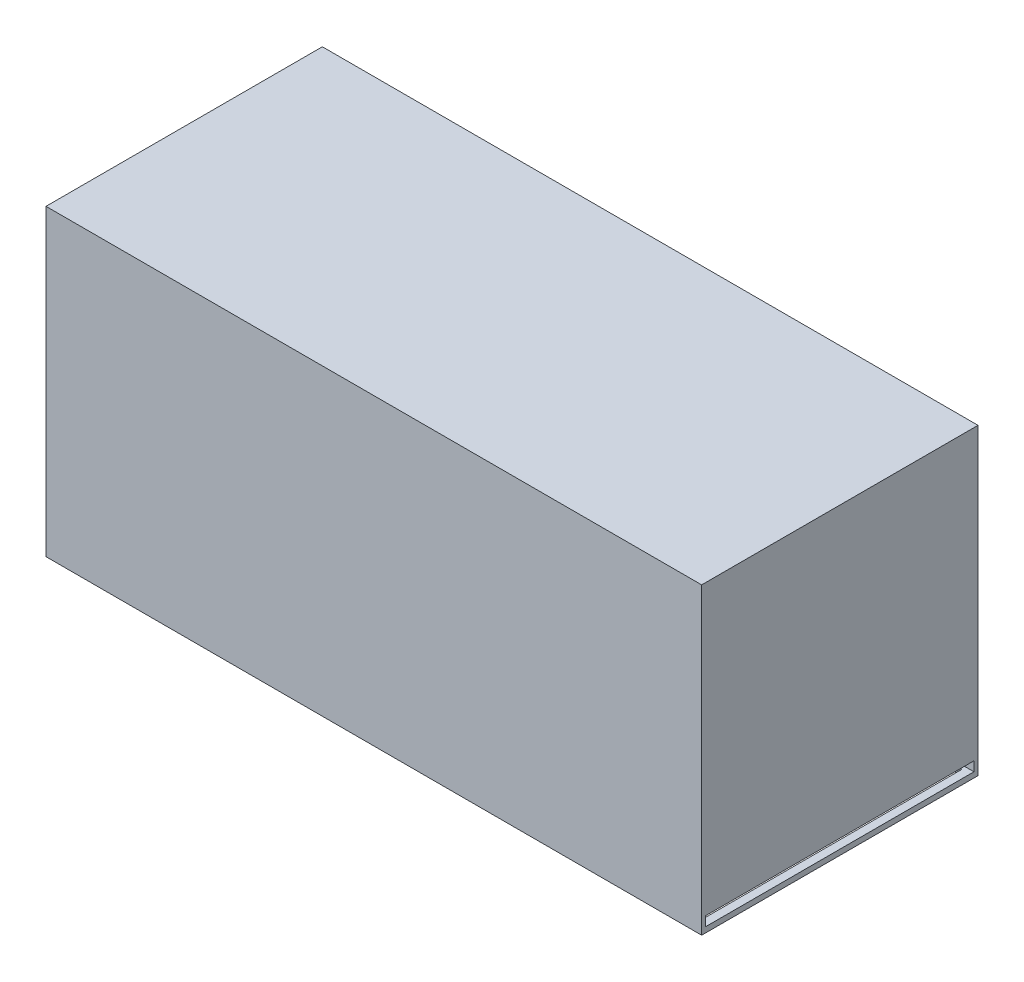
ISO-10303-21;
HEADER;
FILE_DESCRIPTION(('STEP AP214'),'2;1');
FILE_NAME('part.step','',(''),(''),'','','');
FILE_SCHEMA(('AUTOMOTIVE_DESIGN { 1 0 10303 214 1 1 1 1 }'));
ENDSEC;
DATA;
#1=APPLICATION_CONTEXT('core data for automotive mechanical design processes');
#2=APPLICATION_PROTOCOL_DEFINITION('international standard','automotive_design',2000,#1);
#3=PRODUCT_CONTEXT('',#1,'mechanical');
#4=PRODUCT('Part','Part','',(#3));
#5=PRODUCT_RELATED_PRODUCT_CATEGORY('part','',(#4));
#6=PRODUCT_DEFINITION_FORMATION('','',#4);
#7=PRODUCT_DEFINITION_CONTEXT('part definition',#1,'design');
#8=PRODUCT_DEFINITION('design','',#6,#7);
#9=PRODUCT_DEFINITION_SHAPE('','',#8);
#10=(LENGTH_UNIT() NAMED_UNIT(*) SI_UNIT(.MILLI.,.METRE.));
#11=(NAMED_UNIT(*) PLANE_ANGLE_UNIT() SI_UNIT($,.RADIAN.));
#12=(NAMED_UNIT(*) SI_UNIT($,.STERADIAN.) SOLID_ANGLE_UNIT());
#13=UNCERTAINTY_MEASURE_WITH_UNIT(LENGTH_MEASURE(1.E-05),#10,'distance_accuracy_value','');
#14=(GEOMETRIC_REPRESENTATION_CONTEXT(3) GLOBAL_UNCERTAINTY_ASSIGNED_CONTEXT((#13)) GLOBAL_UNIT_ASSIGNED_CONTEXT((#10,
#11,#12)) REPRESENTATION_CONTEXT('',''));
#15=CARTESIAN_POINT('',(0.,0.,0.));
#16=DIRECTION('',(0.,0.,1.));
#17=DIRECTION('',(1.,0.,0.));
#18=AXIS2_PLACEMENT_3D('',#15,#16,#17);
#19=CARTESIAN_POINT('',(119.5,53.,49.5));
#20=DIRECTION('',(1.,0.,0.));
#21=DIRECTION('',(0.,0.,-1.));
#22=AXIS2_PLACEMENT_3D('',#19,#20,#21);
#23=PLANE('',#22);
#24=DIRECTION('',(0.,-1.,0.));
#25=VECTOR('',#24,1.);
#26=CARTESIAN_POINT('',(119.5,53.,1.49999999999999));
#27=LINE('',#26,#25);
#28=CARTESIAN_POINT('',(119.5,53.,1.49999999999999));
#29=VERTEX_POINT('',#28);
#30=CARTESIAN_POINT('',(119.5,2.74999999999997,1.49999999999999));
#31=VERTEX_POINT('',#30);
#32=EDGE_CURVE('E482',#29,#31,#27,.T.);
#33=ORIENTED_EDGE('',*,*,#32,.T.);
#34=DIRECTION('',(0.,0.,1.));
#35=VECTOR('',#34,1.);
#36=CARTESIAN_POINT('',(119.5,2.75,49.5));
#37=LINE('',#36,#35);
#38=CARTESIAN_POINT('',(119.5,2.75,49.5));
#39=VERTEX_POINT('',#38);
#40=EDGE_CURVE('E295',#31,#39,#37,.T.);
#41=ORIENTED_EDGE('',*,*,#40,.T.);
#42=DIRECTION('',(0.,-1.,0.));
#43=VECTOR('',#42,1.);
#44=CARTESIAN_POINT('',(119.5,53.,49.5));
#45=LINE('',#44,#43);
#46=CARTESIAN_POINT('',(119.5,53.,49.5));
#47=VERTEX_POINT('',#46);
#48=EDGE_CURVE('E477',#47,#39,#45,.T.);
#49=ORIENTED_EDGE('',*,*,#48,.F.);
#50=DIRECTION('',(0.,0.,1.));
#51=VECTOR('',#50,1.);
#52=CARTESIAN_POINT('',(119.5,53.,49.5));
#53=LINE('',#52,#51);
#54=CARTESIAN_POINT('',(119.5,53.,7.49999999999999));
#55=VERTEX_POINT('',#54);
#56=EDGE_CURVE('E446',#55,#47,#53,.T.);
#57=ORIENTED_EDGE('',*,*,#56,.F.);
#58=DIRECTION('',(0.,1.,0.));
#59=VECTOR('',#58,1.);
#60=CARTESIAN_POINT('',(119.5,51.,7.5));
#61=LINE('',#60,#59);
#62=CARTESIAN_POINT('',(119.5,3.,7.49999999999999));
#63=VERTEX_POINT('',#62);
#64=EDGE_CURVE('E351',#63,#55,#61,.T.);
#65=ORIENTED_EDGE('',*,*,#64,.F.);
#66=DIRECTION('',(0.,0.,1.));
#67=VECTOR('',#66,1.);
#68=CARTESIAN_POINT('',(119.5,3.,7.49999999999999));
#69=LINE('',#68,#67);
#70=CARTESIAN_POINT('',(119.5,3.,6.5));
#71=VERTEX_POINT('',#70);
#72=EDGE_CURVE('E312',#71,#63,#69,.T.);
#73=ORIENTED_EDGE('',*,*,#72,.F.);
#74=DIRECTION('',(0.,1.,0.));
#75=VECTOR('',#74,1.);
#76=CARTESIAN_POINT('',(119.5,51.,6.49999999999999));
#77=LINE('',#76,#75);
#78=CARTESIAN_POINT('',(119.5,53.,6.5));
#79=VERTEX_POINT('',#78);
#80=EDGE_CURVE('E355',#71,#79,#77,.T.);
#81=ORIENTED_EDGE('',*,*,#80,.T.);
#82=EDGE_CURVE('E447',#29,#79,#53,.T.);
#83=ORIENTED_EDGE('',*,*,#82,.F.);
#84=EDGE_LOOP('',(#33,#41,#49,#57,#65,#73,#81,#83));
#85=FACE_BOUND('',#84,.T.);
#86=ADVANCED_FACE('F39',(#85),#23,.F.);
#87=CARTESIAN_POINT('',(1.5,53.,49.5));
#88=DIRECTION('',(-1.,0.,0.));
#89=DIRECTION('',(0.,0.,1.));
#90=AXIS2_PLACEMENT_3D('',#87,#88,#89);
#91=PLANE('',#90);
#92=DIRECTION('',(0.,-1.,0.));
#93=VECTOR('',#92,1.);
#94=CARTESIAN_POINT('',(1.5,53.,49.5));
#95=LINE('',#94,#93);
#96=CARTESIAN_POINT('',(1.5,5.,49.5));
#97=VERTEX_POINT('',#96);
#98=CARTESIAN_POINT('',(1.5,2.74999999999994,49.5));
#99=VERTEX_POINT('',#98);
#100=EDGE_CURVE('E471',#97,#99,#95,.T.);
#101=ORIENTED_EDGE('',*,*,#100,.T.);
#102=DIRECTION('',(0.,0.,-1.));
#103=VECTOR('',#102,1.);
#104=CARTESIAN_POINT('',(1.5,2.74999999999994,49.5));
#105=LINE('',#104,#103);
#106=CARTESIAN_POINT('',(1.50000000000001,2.74999999999994,1.49999999999999));
#107=VERTEX_POINT('',#106);
#108=EDGE_CURVE('E291',#99,#107,#105,.T.);
#109=ORIENTED_EDGE('',*,*,#108,.T.);
#110=DIRECTION('',(0.,-1.,0.));
#111=VECTOR('',#110,1.);
#112=CARTESIAN_POINT('',(1.50000000000001,53.,1.49999999999999));
#113=LINE('',#112,#111);
#114=CARTESIAN_POINT('',(1.50000000000001,53.,1.49999999999999));
#115=VERTEX_POINT('',#114);
#116=EDGE_CURVE('E487',#115,#107,#113,.T.);
#117=ORIENTED_EDGE('',*,*,#116,.F.);
#118=DIRECTION('',(0.,0.,-1.));
#119=VECTOR('',#118,1.);
#120=CARTESIAN_POINT('',(1.5,53.,49.5));
#121=LINE('',#120,#119);
#122=CARTESIAN_POINT('',(1.50000000000001,53.,6.5));
#123=VERTEX_POINT('',#122);
#124=EDGE_CURVE('E442',#123,#115,#121,.T.);
#125=ORIENTED_EDGE('',*,*,#124,.F.);
#126=DIRECTION('',(0.,1.,0.));
#127=VECTOR('',#126,1.);
#128=CARTESIAN_POINT('',(1.5,51.,6.5));
#129=LINE('',#128,#127);
#130=CARTESIAN_POINT('',(1.50000000000001,51.,6.5));
#131=VERTEX_POINT('',#130);
#132=EDGE_CURVE('E358',#131,#123,#129,.T.);
#133=ORIENTED_EDGE('',*,*,#132,.F.);
#134=DIRECTION('',(0.,0.,-1.));
#135=VECTOR('',#134,1.);
#136=CARTESIAN_POINT('',(1.5,51.,6.5));
#137=LINE('',#136,#135);
#138=CARTESIAN_POINT('',(1.50000000000001,51.,7.49999999999999));
#139=VERTEX_POINT('',#138);
#140=EDGE_CURVE('E331',#139,#131,#137,.T.);
#141=ORIENTED_EDGE('',*,*,#140,.F.);
#142=DIRECTION('',(0.,1.,0.));
#143=VECTOR('',#142,1.);
#144=CARTESIAN_POINT('',(1.5,51.,7.5));
#145=LINE('',#144,#143);
#146=CARTESIAN_POINT('',(1.50000000000001,53.,7.49999999999999));
#147=VERTEX_POINT('',#146);
#148=EDGE_CURVE('E342',#139,#147,#145,.T.);
#149=ORIENTED_EDGE('',*,*,#148,.T.);
#150=CARTESIAN_POINT('',(1.5,53.,21.5));
#151=VERTEX_POINT('',#150);
#152=EDGE_CURVE('E437',#151,#147,#121,.T.);
#153=ORIENTED_EDGE('',*,*,#152,.F.);
#154=DIRECTION('',(0.,1.,0.));
#155=VECTOR('',#154,1.);
#156=CARTESIAN_POINT('',(1.5,5.,21.5));
#157=LINE('',#156,#155);
#158=CARTESIAN_POINT('',(1.5,5.,21.5));
#159=VERTEX_POINT('',#158);
#160=EDGE_CURVE('E433',#159,#151,#157,.T.);
#161=ORIENTED_EDGE('',*,*,#160,.F.);
#162=DIRECTION('',(0.,0.,-1.));
#163=VECTOR('',#162,1.);
#164=CARTESIAN_POINT('',(1.5,5.,49.5));
#165=LINE('',#164,#163);
#166=EDGE_CURVE('E407',#97,#159,#165,.T.);
#167=ORIENTED_EDGE('',*,*,#166,.F.);
#168=EDGE_LOOP('',(#101,#109,#117,#125,#133,#141,#149,#153,#161,#167));
#169=FACE_BOUND('',#168,.T.);
#170=ADVANCED_FACE('F551',(#169),#91,.F.);
#171=CARTESIAN_POINT('',(1.5,53.,49.5));
#172=DIRECTION('',(0.,0.,1.));
#173=DIRECTION('',(1.,0.,0.));
#174=AXIS2_PLACEMENT_3D('',#171,#172,#173);
#175=PLANE('',#174);
#176=ORIENTED_EDGE('',*,*,#48,.T.);
#177=DIRECTION('',(-1.,0.,0.));
#178=VECTOR('',#177,1.);
#179=CARTESIAN_POINT('',(1.50000000000002,2.74999999999994,49.5));
#180=LINE('',#179,#178);
#181=EDGE_CURVE('E299',#39,#99,#180,.T.);
#182=ORIENTED_EDGE('',*,*,#181,.T.);
#183=ORIENTED_EDGE('',*,*,#100,.F.);
#184=DIRECTION('',(-1.,0.,0.));
#185=VECTOR('',#184,1.);
#186=CARTESIAN_POINT('',(1.5,5.,49.5));
#187=LINE('',#186,#185);
#188=CARTESIAN_POINT('',(23.5,5.,49.5));
#189=VERTEX_POINT('',#188);
#190=EDGE_CURVE('E418',#189,#97,#187,.T.);
#191=ORIENTED_EDGE('',*,*,#190,.F.);
#192=DIRECTION('',(0.,1.,0.));
#193=VECTOR('',#192,1.);
#194=CARTESIAN_POINT('',(23.5,5.,49.5));
#195=LINE('',#194,#193);
#196=CARTESIAN_POINT('',(23.5,53.,49.5));
#197=VERTEX_POINT('',#196);
#198=EDGE_CURVE('E421',#189,#197,#195,.T.);
#199=ORIENTED_EDGE('',*,*,#198,.T.);
#200=DIRECTION('',(-1.,0.,0.));
#201=VECTOR('',#200,1.);
#202=CARTESIAN_POINT('',(1.5,53.,49.5));
#203=LINE('',#202,#201);
#204=EDGE_CURVE('E451',#47,#197,#203,.T.);
#205=ORIENTED_EDGE('',*,*,#204,.F.);
#206=EDGE_LOOP('',(#176,#182,#183,#191,#199,#205));
#207=FACE_BOUND('',#206,.T.);
#208=ADVANCED_FACE('F576',(#207),#175,.F.);
#209=CARTESIAN_POINT('',(1.50000000000001,53.,1.49999999999999));
#210=DIRECTION('',(0.,0.,-1.));
#211=DIRECTION('',(-1.,0.,0.));
#212=AXIS2_PLACEMENT_3D('',#209,#210,#211);
#213=PLANE('',#212);
#214=ORIENTED_EDGE('',*,*,#116,.T.);
#215=DIRECTION('',(1.,0.,0.));
#216=VECTOR('',#215,1.);
#217=CARTESIAN_POINT('',(1.50000000000003,2.74999999999994,1.49999999999999));
#218=LINE('',#217,#216);
#219=EDGE_CURVE('E11',#107,#31,#218,.T.);
#220=ORIENTED_EDGE('',*,*,#219,.T.);
#221=ORIENTED_EDGE('',*,*,#32,.F.);
#222=DIRECTION('',(1.,0.,0.));
#223=VECTOR('',#222,1.);
#224=CARTESIAN_POINT('',(1.50000000000001,53.,1.49999999999999));
#225=LINE('',#224,#223);
#226=EDGE_CURVE('E441',#115,#29,#225,.T.);
#227=ORIENTED_EDGE('',*,*,#226,.F.);
#228=EDGE_LOOP('',(#214,#220,#221,#227));
#229=FACE_BOUND('',#228,.T.);
#230=ADVANCED_FACE('F553',(#229),#213,.F.);
#231=CARTESIAN_POINT('',(0.,51.,0.));
#232=DIRECTION('',(0.,1.,0.));
#233=DIRECTION('',(0.,0.,1.));
#234=AXIS2_PLACEMENT_3D('',#231,#232,#233);
#235=PLANE('',#234);
#236=DIRECTION('',(0.,0.,-1.));
#237=VECTOR('',#236,1.);
#238=CARTESIAN_POINT('',(116.5,51.,7.49999999999999));
#239=LINE('',#238,#237);
#240=CARTESIAN_POINT('',(116.5,51.,7.49999999999999));
#241=VERTEX_POINT('',#240);
#242=CARTESIAN_POINT('',(116.5,51.,6.49999999999999));
#243=VERTEX_POINT('',#242);
#244=EDGE_CURVE('E303',#241,#243,#239,.T.);
#245=ORIENTED_EDGE('',*,*,#244,.F.);
#246=DIRECTION('',(-1.,0.,0.));
#247=VECTOR('',#246,1.);
#248=CARTESIAN_POINT('',(1.5,51.,7.5));
#249=LINE('',#248,#247);
#250=EDGE_CURVE('E339',#241,#139,#249,.T.);
#251=ORIENTED_EDGE('',*,*,#250,.T.);
#252=ORIENTED_EDGE('',*,*,#140,.T.);
#253=DIRECTION('',(1.,0.,0.));
#254=VECTOR('',#253,1.);
#255=CARTESIAN_POINT('',(1.5,51.,6.5));
#256=LINE('',#255,#254);
#257=EDGE_CURVE('E335',#131,#243,#256,.T.);
#258=ORIENTED_EDGE('',*,*,#257,.T.);
#259=EDGE_LOOP('',(#245,#251,#252,#258));
#260=FACE_BOUND('',#259,.T.);
#261=ADVANCED_FACE('F641',(#260),#235,.F.);
#262=CARTESIAN_POINT('',(0.,53.,0.));
#263=DIRECTION('',(0.,-1.,0.));
#264=DIRECTION('',(0.,0.,-1.));
#265=AXIS2_PLACEMENT_3D('',#262,#263,#264);
#266=PLANE('',#265);
#267=ORIENTED_EDGE('',*,*,#82,.T.);
#268=DIRECTION('',(1.,0.,0.));
#269=VECTOR('',#268,1.);
#270=CARTESIAN_POINT('',(1.5,53.,6.5));
#271=LINE('',#270,#269);
#272=EDGE_CURVE('E330',#123,#79,#271,.T.);
#273=ORIENTED_EDGE('',*,*,#272,.F.);
#274=ORIENTED_EDGE('',*,*,#124,.T.);
#275=ORIENTED_EDGE('',*,*,#226,.T.);
#276=EDGE_LOOP('',(#267,#273,#274,#275));
#277=FACE_BOUND('',#276,.T.);
#278=ADVANCED_FACE('F548',(#277),#266,.T.);
#279=ORIENTED_EDGE('',*,*,#152,.T.);
#280=DIRECTION('',(-1.,0.,0.));
#281=VECTOR('',#280,1.);
#282=CARTESIAN_POINT('',(1.5,53.,7.5));
#283=LINE('',#282,#281);
#284=EDGE_CURVE('E336',#55,#147,#283,.T.);
#285=ORIENTED_EDGE('',*,*,#284,.F.);
#286=ORIENTED_EDGE('',*,*,#56,.T.);
#287=ORIENTED_EDGE('',*,*,#204,.T.);
#288=DIRECTION('',(0.,0.,1.));
#289=VECTOR('',#288,1.);
#290=CARTESIAN_POINT('',(23.5,53.,49.5));
#291=LINE('',#290,#289);
#292=CARTESIAN_POINT('',(23.5,53.,21.5));
#293=VERTEX_POINT('',#292);
#294=EDGE_CURVE('E412',#293,#197,#291,.T.);
#295=ORIENTED_EDGE('',*,*,#294,.F.);
#296=DIRECTION('',(1.,0.,0.));
#297=VECTOR('',#296,1.);
#298=CARTESIAN_POINT('',(1.5,53.,21.5));
#299=LINE('',#298,#297);
#300=EDGE_CURVE('E397',#151,#293,#299,.T.);
#301=ORIENTED_EDGE('',*,*,#300,.F.);
#302=EDGE_LOOP('',(#279,#285,#286,#287,#295,#301));
#303=FACE_BOUND('',#302,.T.);
#304=ADVANCED_FACE('F571',(#303),#266,.T.);
#305=CARTESIAN_POINT('',(1.5,5.,21.5));
#306=DIRECTION('',(0.,0.,1.));
#307=DIRECTION('',(1.,0.,0.));
#308=AXIS2_PLACEMENT_3D('',#305,#306,#307);
#309=PLANE('',#308);
#310=ORIENTED_EDGE('',*,*,#300,.T.);
#311=DIRECTION('',(0.,1.,0.));
#312=VECTOR('',#311,1.);
#313=CARTESIAN_POINT('',(23.5,5.,21.5));
#314=LINE('',#313,#312);
#315=CARTESIAN_POINT('',(23.5,5.,21.5));
#316=VERTEX_POINT('',#315);
#317=EDGE_CURVE('E430',#316,#293,#314,.T.);
#318=ORIENTED_EDGE('',*,*,#317,.F.);
#319=DIRECTION('',(1.,0.,0.));
#320=VECTOR('',#319,1.);
#321=CARTESIAN_POINT('',(1.5,5.,21.5));
#322=LINE('',#321,#320);
#323=EDGE_CURVE('E411',#159,#316,#322,.T.);
#324=ORIENTED_EDGE('',*,*,#323,.F.);
#325=ORIENTED_EDGE('',*,*,#160,.T.);
#326=EDGE_LOOP('',(#310,#318,#324,#325));
#327=FACE_BOUND('',#326,.T.);
#328=ADVANCED_FACE('F585',(#327),#309,.F.);
#329=CARTESIAN_POINT('',(23.5,5.,49.5));
#330=DIRECTION('',(-1.,0.,0.));
#331=DIRECTION('',(0.,0.,1.));
#332=AXIS2_PLACEMENT_3D('',#329,#330,#331);
#333=PLANE('',#332);
#334=ORIENTED_EDGE('',*,*,#294,.T.);
#335=ORIENTED_EDGE('',*,*,#198,.F.);
#336=DIRECTION('',(0.,0.,1.));
#337=VECTOR('',#336,1.);
#338=CARTESIAN_POINT('',(23.5,5.,49.5));
#339=LINE('',#338,#337);
#340=EDGE_CURVE('E415',#316,#189,#339,.T.);
#341=ORIENTED_EDGE('',*,*,#340,.F.);
#342=ORIENTED_EDGE('',*,*,#317,.T.);
#343=EDGE_LOOP('',(#334,#335,#341,#342));
#344=FACE_BOUND('',#343,.T.);
#345=ADVANCED_FACE('F581',(#344),#333,.F.);
#346=CARTESIAN_POINT('',(0.,5.,0.));
#347=DIRECTION('',(0.,-1.,0.));
#348=DIRECTION('',(0.,0.,-1.));
#349=AXIS2_PLACEMENT_3D('',#346,#347,#348);
#350=PLANE('',#349);
#351=DIRECTION('',(0.,0.,-1.));
#352=VECTOR('',#351,1.);
#353=CARTESIAN_POINT('',(2.5,5.,48.5));
#354=LINE('',#353,#352);
#355=CARTESIAN_POINT('',(2.5,5.,48.5));
#356=VERTEX_POINT('',#355);
#357=CARTESIAN_POINT('',(2.50000000000001,5.,22.5));
#358=VERTEX_POINT('',#357);
#359=EDGE_CURVE('E362',#356,#358,#354,.T.);
#360=ORIENTED_EDGE('',*,*,#359,.F.);
#361=DIRECTION('',(-1.,0.,0.));
#362=VECTOR('',#361,1.);
#363=CARTESIAN_POINT('',(2.5,5.,48.5));
#364=LINE('',#363,#362);
#365=CARTESIAN_POINT('',(22.5,5.,48.5));
#366=VERTEX_POINT('',#365);
#367=EDGE_CURVE('E368',#366,#356,#364,.T.);
#368=ORIENTED_EDGE('',*,*,#367,.F.);
#369=DIRECTION('',(0.,0.,1.));
#370=VECTOR('',#369,1.);
#371=CARTESIAN_POINT('',(22.5,5.,48.5));
#372=LINE('',#371,#370);
#373=CARTESIAN_POINT('',(22.5,5.,22.5));
#374=VERTEX_POINT('',#373);
#375=EDGE_CURVE('E387',#374,#366,#372,.T.);
#376=ORIENTED_EDGE('',*,*,#375,.F.);
#377=DIRECTION('',(1.,0.,0.));
#378=VECTOR('',#377,1.);
#379=CARTESIAN_POINT('',(2.50000000000001,5.,22.5));
#380=LINE('',#379,#378);
#381=EDGE_CURVE('E383',#358,#374,#380,.T.);
#382=ORIENTED_EDGE('',*,*,#381,.F.);
#383=EDGE_LOOP('',(#360,#368,#376,#382));
#384=FACE_BOUND('',#383,.T.);
#385=ORIENTED_EDGE('',*,*,#166,.T.);
#386=ORIENTED_EDGE('',*,*,#323,.T.);
#387=ORIENTED_EDGE('',*,*,#340,.T.);
#388=ORIENTED_EDGE('',*,*,#190,.T.);
#389=EDGE_LOOP('',(#385,#386,#387,#388));
#390=FACE_BOUND('',#389,.T.);
#391=ADVANCED_FACE('F716',(#384,#390),#350,.T.);
#392=CARTESIAN_POINT('',(2.5,53.,48.5));
#393=DIRECTION('',(-1.,0.,0.));
#394=DIRECTION('',(0.,0.,1.));
#395=AXIS2_PLACEMENT_3D('',#392,#393,#394);
#396=PLANE('',#395);
#397=ORIENTED_EDGE('',*,*,#359,.T.);
#398=DIRECTION('',(0.,-1.,0.));
#399=VECTOR('',#398,1.);
#400=CARTESIAN_POINT('',(2.50000000000001,53.,22.5));
#401=LINE('',#400,#399);
#402=CARTESIAN_POINT('',(2.50000000000001,53.,22.5));
#403=VERTEX_POINT('',#402);
#404=EDGE_CURVE('E380',#403,#358,#401,.T.);
#405=ORIENTED_EDGE('',*,*,#404,.F.);
#406=DIRECTION('',(0.,0.,-1.));
#407=VECTOR('',#406,1.);
#408=CARTESIAN_POINT('',(2.5,53.,48.5));
#409=LINE('',#408,#407);
#410=CARTESIAN_POINT('',(2.5,53.,48.5));
#411=VERTEX_POINT('',#410);
#412=EDGE_CURVE('E363',#411,#403,#409,.T.);
#413=ORIENTED_EDGE('',*,*,#412,.F.);
#414=DIRECTION('',(0.,-1.,0.));
#415=VECTOR('',#414,1.);
#416=CARTESIAN_POINT('',(2.5,53.,48.5));
#417=LINE('',#416,#415);
#418=EDGE_CURVE('E394',#411,#356,#417,.T.);
#419=ORIENTED_EDGE('',*,*,#418,.T.);
#420=EDGE_LOOP('',(#397,#405,#413,#419));
#421=FACE_BOUND('',#420,.T.);
#422=ADVANCED_FACE('F706',(#421),#396,.F.);
#423=CARTESIAN_POINT('',(2.5,53.,48.5));
#424=DIRECTION('',(0.,0.,1.));
#425=DIRECTION('',(1.,0.,0.));
#426=AXIS2_PLACEMENT_3D('',#423,#424,#425);
#427=PLANE('',#426);
#428=ORIENTED_EDGE('',*,*,#367,.T.);
#429=ORIENTED_EDGE('',*,*,#418,.F.);
#430=DIRECTION('',(-1.,0.,0.));
#431=VECTOR('',#430,1.);
#432=CARTESIAN_POINT('',(2.5,53.,48.5));
#433=LINE('',#432,#431);
#434=CARTESIAN_POINT('',(22.5,53.,48.5));
#435=VERTEX_POINT('',#434);
#436=EDGE_CURVE('E376',#435,#411,#433,.T.);
#437=ORIENTED_EDGE('',*,*,#436,.F.);
#438=DIRECTION('',(0.,-1.,0.));
#439=VECTOR('',#438,1.);
#440=CARTESIAN_POINT('',(22.5,53.,48.5));
#441=LINE('',#440,#439);
#442=EDGE_CURVE('E398',#435,#366,#441,.T.);
#443=ORIENTED_EDGE('',*,*,#442,.T.);
#444=EDGE_LOOP('',(#428,#429,#437,#443));
#445=FACE_BOUND('',#444,.T.);
#446=ADVANCED_FACE('F702',(#445),#427,.F.);
#447=CARTESIAN_POINT('',(22.5,53.,48.5));
#448=DIRECTION('',(1.,0.,0.));
#449=DIRECTION('',(0.,0.,-1.));
#450=AXIS2_PLACEMENT_3D('',#447,#448,#449);
#451=PLANE('',#450);
#452=ORIENTED_EDGE('',*,*,#375,.T.);
#453=ORIENTED_EDGE('',*,*,#442,.F.);
#454=DIRECTION('',(0.,0.,1.));
#455=VECTOR('',#454,1.);
#456=CARTESIAN_POINT('',(22.5,53.,48.5));
#457=LINE('',#456,#455);
#458=CARTESIAN_POINT('',(22.5,53.,22.5));
#459=VERTEX_POINT('',#458);
#460=EDGE_CURVE('E372',#459,#435,#457,.T.);
#461=ORIENTED_EDGE('',*,*,#460,.F.);
#462=DIRECTION('',(0.,-1.,0.));
#463=VECTOR('',#462,1.);
#464=CARTESIAN_POINT('',(22.5,53.,22.5));
#465=LINE('',#464,#463);
#466=EDGE_CURVE('E401',#459,#374,#465,.T.);
#467=ORIENTED_EDGE('',*,*,#466,.T.);
#468=EDGE_LOOP('',(#452,#453,#461,#467));
#469=FACE_BOUND('',#468,.T.);
#470=ADVANCED_FACE('F705',(#469),#451,.F.);
#471=CARTESIAN_POINT('',(2.50000000000001,53.,22.5));
#472=DIRECTION('',(0.,0.,-1.));
#473=DIRECTION('',(-1.,0.,0.));
#474=AXIS2_PLACEMENT_3D('',#471,#472,#473);
#475=PLANE('',#474);
#476=ORIENTED_EDGE('',*,*,#381,.T.);
#477=ORIENTED_EDGE('',*,*,#466,.F.);
#478=DIRECTION('',(1.,0.,0.));
#479=VECTOR('',#478,1.);
#480=CARTESIAN_POINT('',(2.50000000000001,53.,22.5));
#481=LINE('',#480,#479);
#482=EDGE_CURVE('E367',#403,#459,#481,.T.);
#483=ORIENTED_EDGE('',*,*,#482,.F.);
#484=ORIENTED_EDGE('',*,*,#404,.T.);
#485=EDGE_LOOP('',(#476,#477,#483,#484));
#486=FACE_BOUND('',#485,.T.);
#487=ADVANCED_FACE('F700',(#486),#475,.F.);
#488=CARTESIAN_POINT('',(0.,53.,0.));
#489=DIRECTION('',(0.,-1.,0.));
#490=DIRECTION('',(0.,0.,-1.));
#491=AXIS2_PLACEMENT_3D('',#488,#489,#490);
#492=PLANE('',#491);
#493=ORIENTED_EDGE('',*,*,#412,.T.);
#494=ORIENTED_EDGE('',*,*,#482,.T.);
#495=ORIENTED_EDGE('',*,*,#460,.T.);
#496=ORIENTED_EDGE('',*,*,#436,.T.);
#497=EDGE_LOOP('',(#493,#494,#495,#496));
#498=FACE_BOUND('',#497,.T.);
#499=ADVANCED_FACE('F697',(#498),#492,.T.);
#500=CARTESIAN_POINT('',(1.5,51.,6.5));
#501=DIRECTION('',(0.,0.,1.));
#502=DIRECTION('',(1.,0.,0.));
#503=AXIS2_PLACEMENT_3D('',#500,#501,#502);
#504=PLANE('',#503);
#505=ORIENTED_EDGE('',*,*,#272,.T.);
#506=ORIENTED_EDGE('',*,*,#80,.F.);
#507=DIRECTION('',(1.,0.,0.));
#508=VECTOR('',#507,1.);
#509=CARTESIAN_POINT('',(116.5,3.,6.5));
#510=LINE('',#509,#508);
#511=CARTESIAN_POINT('',(116.5,3.,6.5));
#512=VERTEX_POINT('',#511);
#513=EDGE_CURVE('E308',#512,#71,#510,.T.);
#514=ORIENTED_EDGE('',*,*,#513,.F.);
#515=DIRECTION('',(0.,1.,0.));
#516=VECTOR('',#515,1.);
#517=CARTESIAN_POINT('',(116.5,3.,6.5));
#518=LINE('',#517,#516);
#519=EDGE_CURVE('E326',#512,#243,#518,.T.);
#520=ORIENTED_EDGE('',*,*,#519,.T.);
#521=ORIENTED_EDGE('',*,*,#257,.F.);
#522=ORIENTED_EDGE('',*,*,#132,.T.);
#523=EDGE_LOOP('',(#505,#506,#514,#520,#521,#522));
#524=FACE_BOUND('',#523,.T.);
#525=ADVANCED_FACE('F558',(#524),#504,.F.);
#526=CARTESIAN_POINT('',(1.5,51.,7.5));
#527=DIRECTION('',(0.,0.,-1.));
#528=DIRECTION('',(-1.,0.,0.));
#529=AXIS2_PLACEMENT_3D('',#526,#527,#528);
#530=PLANE('',#529);
#531=ORIENTED_EDGE('',*,*,#284,.T.);
#532=ORIENTED_EDGE('',*,*,#148,.F.);
#533=ORIENTED_EDGE('',*,*,#250,.F.);
#534=DIRECTION('',(0.,1.,0.));
#535=VECTOR('',#534,1.);
#536=CARTESIAN_POINT('',(116.5,3.,7.49999999999999));
#537=LINE('',#536,#535);
#538=CARTESIAN_POINT('',(116.5,3.,7.49999999999999));
#539=VERTEX_POINT('',#538);
#540=EDGE_CURVE('E319',#539,#241,#537,.T.);
#541=ORIENTED_EDGE('',*,*,#540,.F.);
#542=DIRECTION('',(-1.,0.,0.));
#543=VECTOR('',#542,1.);
#544=CARTESIAN_POINT('',(116.5,3.,7.49999999999999));
#545=LINE('',#544,#543);
#546=EDGE_CURVE('E316',#63,#539,#545,.T.);
#547=ORIENTED_EDGE('',*,*,#546,.F.);
#548=ORIENTED_EDGE('',*,*,#64,.T.);
#549=EDGE_LOOP('',(#531,#532,#533,#541,#547,#548));
#550=FACE_BOUND('',#549,.T.);
#551=ADVANCED_FACE('F565',(#550),#530,.F.);
#552=CARTESIAN_POINT('',(116.5,3.,7.49999999999999));
#553=DIRECTION('',(1.,0.,0.));
#554=DIRECTION('',(0.,0.,-1.));
#555=AXIS2_PLACEMENT_3D('',#552,#553,#554);
#556=PLANE('',#555);
#557=ORIENTED_EDGE('',*,*,#244,.T.);
#558=ORIENTED_EDGE('',*,*,#519,.F.);
#559=DIRECTION('',(0.,0.,-1.));
#560=VECTOR('',#559,1.);
#561=CARTESIAN_POINT('',(116.5,3.,7.49999999999999));
#562=LINE('',#561,#560);
#563=EDGE_CURVE('E304',#539,#512,#562,.T.);
#564=ORIENTED_EDGE('',*,*,#563,.F.);
#565=ORIENTED_EDGE('',*,*,#540,.T.);
#566=EDGE_LOOP('',(#557,#558,#564,#565));
#567=FACE_BOUND('',#566,.T.);
#568=ADVANCED_FACE('F601',(#567),#556,.F.);
#569=CARTESIAN_POINT('',(0.,3.,0.));
#570=DIRECTION('',(0.,-1.,0.));
#571=DIRECTION('',(0.,0.,-1.));
#572=AXIS2_PLACEMENT_3D('',#569,#570,#571);
#573=PLANE('',#572);
#574=ORIENTED_EDGE('',*,*,#563,.T.);
#575=ORIENTED_EDGE('',*,*,#513,.T.);
#576=ORIENTED_EDGE('',*,*,#72,.T.);
#577=ORIENTED_EDGE('',*,*,#546,.T.);
#578=EDGE_LOOP('',(#574,#575,#576,#577));
#579=FACE_BOUND('',#578,.T.);
#580=ADVANCED_FACE('F593',(#579),#573,.T.);
#581=CARTESIAN_POINT('',(1.00000000000001,2.74999999999994,50.25));
#582=DIRECTION('',(0.,1.,0.));
#583=DIRECTION('',(-1.,0.,0.));
#584=AXIS2_PLACEMENT_3D('',#581,#582,#583);
#585=PLANE('',#584);
#586=DIRECTION('',(0.,0.,1.));
#587=VECTOR('',#586,1.);
#588=CARTESIAN_POINT('',(121.,2.75,50.25));
#589=LINE('',#588,#587);
#590=CARTESIAN_POINT('',(121.,2.75,0.750000000000001));
#591=VERTEX_POINT('',#590);
#592=CARTESIAN_POINT('',(121.,2.75,50.25));
#593=VERTEX_POINT('',#592);
#594=EDGE_CURVE('E254',#591,#593,#589,.T.);
#595=ORIENTED_EDGE('',*,*,#594,.T.);
#596=DIRECTION('',(1.,0.,0.));
#597=VECTOR('',#596,1.);
#598=CARTESIAN_POINT('',(1.00000000000001,2.74999999999994,50.25));
#599=LINE('',#598,#597);
#600=CARTESIAN_POINT('',(1.00000000000001,2.74999999999994,50.25));
#601=VERTEX_POINT('',#600);
#602=EDGE_CURVE('E273',#601,#593,#599,.T.);
#603=ORIENTED_EDGE('',*,*,#602,.F.);
#604=DIRECTION('',(0.,0.,1.));
#605=VECTOR('',#604,1.);
#606=CARTESIAN_POINT('',(1.00000000000001,2.74999999999994,50.25));
#607=LINE('',#606,#605);
#608=CARTESIAN_POINT('',(1.00000000000001,2.74999999999994,0.750000000000001));
#609=VERTEX_POINT('',#608);
#610=EDGE_CURVE('E240',#609,#601,#607,.T.);
#611=ORIENTED_EDGE('',*,*,#610,.F.);
#612=DIRECTION('',(1.,0.,0.));
#613=VECTOR('',#612,1.);
#614=CARTESIAN_POINT('',(1.00000000000001,2.74999999999994,0.750000000000001));
#615=LINE('',#614,#613);
#616=EDGE_CURVE('E276',#609,#591,#615,.T.);
#617=ORIENTED_EDGE('',*,*,#616,.T.);
#618=EDGE_LOOP('',(#595,#603,#611,#617));
#619=FACE_BOUND('',#618,.T.);
#620=ORIENTED_EDGE('',*,*,#40,.F.);
#621=ORIENTED_EDGE('',*,*,#219,.F.);
#622=ORIENTED_EDGE('',*,*,#108,.F.);
#623=ORIENTED_EDGE('',*,*,#181,.F.);
#624=EDGE_LOOP('',(#620,#621,#622,#623));
#625=FACE_BOUND('',#624,.T.);
#626=ADVANCED_FACE('F591',(#619,#625),#585,.F.);
#627=CARTESIAN_POINT('',(1.00000000000001,0.999999999999941,50.25));
#628=DIRECTION('',(0.,-1.,0.));
#629=DIRECTION('',(1.,0.,0.));
#630=AXIS2_PLACEMENT_3D('',#627,#628,#629);
#631=PLANE('',#630);
#632=DIRECTION('',(0.,0.,-1.));
#633=VECTOR('',#632,1.);
#634=CARTESIAN_POINT('',(121.,1.,50.25));
#635=LINE('',#634,#633);
#636=CARTESIAN_POINT('',(121.,1.,50.25));
#637=VERTEX_POINT('',#636);
#638=CARTESIAN_POINT('',(121.,1.,0.750000000000001));
#639=VERTEX_POINT('',#638);
#640=EDGE_CURVE('E267',#637,#639,#635,.T.);
#641=ORIENTED_EDGE('',*,*,#640,.T.);
#642=DIRECTION('',(1.,0.,0.));
#643=VECTOR('',#642,1.);
#644=CARTESIAN_POINT('',(1.00000000000001,0.999999999999941,0.750000000000001));
#645=LINE('',#644,#643);
#646=CARTESIAN_POINT('',(1.00000000000001,0.999999999999941,0.750000000000001));
#647=VERTEX_POINT('',#646);
#648=EDGE_CURVE('E239',#647,#639,#645,.T.);
#649=ORIENTED_EDGE('',*,*,#648,.F.);
#650=DIRECTION('',(0.,0.,-1.));
#651=VECTOR('',#650,1.);
#652=CARTESIAN_POINT('',(1.00000000000001,0.999999999999941,50.25));
#653=LINE('',#652,#651);
#654=CARTESIAN_POINT('',(1.00000000000001,0.999999999999941,50.25));
#655=VERTEX_POINT('',#654);
#656=EDGE_CURVE('E243',#655,#647,#653,.T.);
#657=ORIENTED_EDGE('',*,*,#656,.F.);
#658=DIRECTION('',(1.,0.,0.));
#659=VECTOR('',#658,1.);
#660=CARTESIAN_POINT('',(1.00000000000001,0.999999999999941,50.25));
#661=LINE('',#660,#659);
#662=EDGE_CURVE('E229',#655,#637,#661,.T.);
#663=ORIENTED_EDGE('',*,*,#662,.T.);
#664=EDGE_LOOP('',(#641,#649,#657,#663));
#665=FACE_BOUND('',#664,.T.);
#666=DIRECTION('',(0.,0.,1.));
#667=VECTOR('',#666,1.);
#668=CARTESIAN_POINT('',(1.5,0.999999999999938,49.5));
#669=LINE('',#668,#667);
#670=CARTESIAN_POINT('',(1.50000000000001,0.999999999999966,1.49999999999999));
#671=VERTEX_POINT('',#670);
#672=CARTESIAN_POINT('',(1.5,0.999999999999938,49.5));
#673=VERTEX_POINT('',#672);
#674=EDGE_CURVE('E63',#671,#673,#669,.T.);
#675=ORIENTED_EDGE('',*,*,#674,.F.);
#676=DIRECTION('',(-1.,0.,0.));
#677=VECTOR('',#676,1.);
#678=CARTESIAN_POINT('',(1.50000000000003,0.999999999999938,1.49999999999999));
#679=LINE('',#678,#677);
#680=CARTESIAN_POINT('',(119.5,0.999999999999997,1.49999999999999));
#681=VERTEX_POINT('',#680);
#682=EDGE_CURVE('E48',#681,#671,#679,.T.);
#683=ORIENTED_EDGE('',*,*,#682,.F.);
#684=DIRECTION('',(0.,0.,-1.));
#685=VECTOR('',#684,1.);
#686=CARTESIAN_POINT('',(119.5,0.999999999999994,49.5));
#687=LINE('',#686,#685);
#688=CARTESIAN_POINT('',(119.5,0.999999999999994,49.5));
#689=VERTEX_POINT('',#688);
#690=EDGE_CURVE('E283',#689,#681,#687,.T.);
#691=ORIENTED_EDGE('',*,*,#690,.F.);
#692=DIRECTION('',(1.,0.,0.));
#693=VECTOR('',#692,1.);
#694=CARTESIAN_POINT('',(1.50000000000003,0.999999999999938,49.5));
#695=LINE('',#694,#693);
#696=EDGE_CURVE('E287',#673,#689,#695,.T.);
#697=ORIENTED_EDGE('',*,*,#696,.F.);
#698=EDGE_LOOP('',(#675,#683,#691,#697));
#699=FACE_BOUND('',#698,.T.);
#700=ADVANCED_FACE('F244',(#665,#699),#631,.F.);
#701=CARTESIAN_POINT('',(1.00000000000001,2.74999999999994,50.25));
#702=DIRECTION('',(0.,0.,1.));
#703=DIRECTION('',(1.,0.,0.));
#704=AXIS2_PLACEMENT_3D('',#701,#702,#703);
#705=PLANE('',#704);
#706=DIRECTION('',(0.,-1.,0.));
#707=VECTOR('',#706,1.);
#708=CARTESIAN_POINT('',(121.,2.75,50.25));
#709=LINE('',#708,#707);
#710=EDGE_CURVE('E55',#593,#637,#709,.T.);
#711=ORIENTED_EDGE('',*,*,#710,.T.);
#712=ORIENTED_EDGE('',*,*,#662,.F.);
#713=DIRECTION('',(0.,-1.,0.));
#714=VECTOR('',#713,1.);
#715=CARTESIAN_POINT('',(1.00000000000001,2.74999999999994,50.25));
#716=LINE('',#715,#714);
#717=EDGE_CURVE('E233',#601,#655,#716,.T.);
#718=ORIENTED_EDGE('',*,*,#717,.F.);
#719=ORIENTED_EDGE('',*,*,#602,.T.);
#720=EDGE_LOOP('',(#711,#712,#718,#719));
#721=FACE_BOUND('',#720,.T.);
#722=ADVANCED_FACE('F231',(#721),#705,.F.);
#723=CARTESIAN_POINT('',(1.00000000000001,2.74999999999994,0.750000000000001));
#724=DIRECTION('',(0.,0.,-1.));
#725=DIRECTION('',(-1.,0.,0.));
#726=AXIS2_PLACEMENT_3D('',#723,#724,#725);
#727=PLANE('',#726);
#728=DIRECTION('',(0.,1.,0.));
#729=VECTOR('',#728,1.);
#730=CARTESIAN_POINT('',(121.,2.75,0.750000000000001));
#731=LINE('',#730,#729);
#732=EDGE_CURVE('E258',#639,#591,#731,.T.);
#733=ORIENTED_EDGE('',*,*,#732,.T.);
#734=ORIENTED_EDGE('',*,*,#616,.F.);
#735=DIRECTION('',(0.,1.,0.));
#736=VECTOR('',#735,1.);
#737=CARTESIAN_POINT('',(1.00000000000001,2.74999999999994,0.750000000000001));
#738=LINE('',#737,#736);
#739=EDGE_CURVE('E249',#647,#609,#738,.T.);
#740=ORIENTED_EDGE('',*,*,#739,.F.);
#741=ORIENTED_EDGE('',*,*,#648,.T.);
#742=EDGE_LOOP('',(#733,#734,#740,#741));
#743=FACE_BOUND('',#742,.T.);
#744=ADVANCED_FACE('F680',(#743),#727,.F.);
#745=CARTESIAN_POINT('',(1.00000000000001,0.,0.));
#746=DIRECTION('',(1.,0.,0.));
#747=DIRECTION('',(0.,0.,-1.));
#748=AXIS2_PLACEMENT_3D('',#745,#746,#747);
#749=PLANE('',#748);
#750=ORIENTED_EDGE('',*,*,#717,.T.);
#751=ORIENTED_EDGE('',*,*,#656,.T.);
#752=ORIENTED_EDGE('',*,*,#739,.T.);
#753=ORIENTED_EDGE('',*,*,#610,.T.);
#754=EDGE_LOOP('',(#750,#751,#752,#753));
#755=FACE_BOUND('',#754,.T.);
#756=ADVANCED_FACE('F251',(#755),#749,.T.);
#757=CARTESIAN_POINT('',(0.,0.,51.));
#758=DIRECTION('',(1.,0.,0.));
#759=DIRECTION('',(0.,1.,0.));
#760=AXIS2_PLACEMENT_3D('',#757,#758,#759);
#761=PLANE('',#760);
#762=DIRECTION('',(0.,-1.,0.));
#763=VECTOR('',#762,1.);
#764=CARTESIAN_POINT('',(0.,0.,0.));
#765=LINE('',#764,#763);
#766=CARTESIAN_POINT('',(0.,56.,0.));
#767=VERTEX_POINT('',#766);
#768=CARTESIAN_POINT('',(0.,0.,0.));
#769=VERTEX_POINT('',#768);
#770=EDGE_CURVE('E475',#767,#769,#765,.T.);
#771=ORIENTED_EDGE('',*,*,#770,.T.);
#772=DIRECTION('',(0.,0.,-1.));
#773=VECTOR('',#772,1.);
#774=CARTESIAN_POINT('',(0.,0.,51.));
#775=LINE('',#774,#773);
#776=CARTESIAN_POINT('',(0.,0.,51.));
#777=VERTEX_POINT('',#776);
#778=EDGE_CURVE('E528',#777,#769,#775,.T.);
#779=ORIENTED_EDGE('',*,*,#778,.F.);
#780=DIRECTION('',(0.,-1.,0.));
#781=VECTOR('',#780,1.);
#782=CARTESIAN_POINT('',(0.,0.,51.));
#783=LINE('',#782,#781);
#784=CARTESIAN_POINT('',(0.,56.,51.));
#785=VERTEX_POINT('',#784);
#786=EDGE_CURVE('E491',#785,#777,#783,.T.);
#787=ORIENTED_EDGE('',*,*,#786,.F.);
#788=DIRECTION('',(0.,0.,-1.));
#789=VECTOR('',#788,1.);
#790=CARTESIAN_POINT('',(0.,56.,51.));
#791=LINE('',#790,#789);
#792=EDGE_CURVE('E505',#785,#767,#791,.T.);
#793=ORIENTED_EDGE('',*,*,#792,.T.);
#794=EDGE_LOOP('',(#771,#779,#787,#793));
#795=FACE_BOUND('',#794,.T.);
#796=ADVANCED_FACE('F41',(#795),#761,.F.);
#797=CARTESIAN_POINT('',(0.,0.,51.));
#798=DIRECTION('',(0.,0.,-1.));
#799=DIRECTION('',(-1.,0.,0.));
#800=AXIS2_PLACEMENT_3D('',#797,#798,#799);
#801=PLANE('',#800);
#802=ORIENTED_EDGE('',*,*,#786,.T.);
#803=DIRECTION('',(1.,0.,0.));
#804=VECTOR('',#803,1.);
#805=CARTESIAN_POINT('',(0.,0.,51.));
#806=LINE('',#805,#804);
#807=CARTESIAN_POINT('',(121.,0.,51.));
#808=VERTEX_POINT('',#807);
#809=EDGE_CURVE('E495',#777,#808,#806,.T.);
#810=ORIENTED_EDGE('',*,*,#809,.T.);
#811=DIRECTION('',(0.,1.,0.));
#812=VECTOR('',#811,1.);
#813=CARTESIAN_POINT('',(121.,0.,51.));
#814=LINE('',#813,#812);
#815=CARTESIAN_POINT('',(121.,56.,51.));
#816=VERTEX_POINT('',#815);
#817=EDGE_CURVE('E499',#808,#816,#814,.T.);
#818=ORIENTED_EDGE('',*,*,#817,.T.);
#819=DIRECTION('',(-1.,0.,0.));
#820=VECTOR('',#819,1.);
#821=CARTESIAN_POINT('',(0.,56.,51.));
#822=LINE('',#821,#820);
#823=EDGE_CURVE('E502',#816,#785,#822,.T.);
#824=ORIENTED_EDGE('',*,*,#823,.T.);
#825=EDGE_LOOP('',(#802,#810,#818,#824));
#826=FACE_BOUND('',#825,.T.);
#827=ADVANCED_FACE('F647',(#826),#801,.F.);
#828=CARTESIAN_POINT('',(0.,56.,51.));
#829=DIRECTION('',(0.,-1.,0.));
#830=DIRECTION('',(0.,0.,-1.));
#831=AXIS2_PLACEMENT_3D('',#828,#829,#830);
#832=PLANE('',#831);
#833=DIRECTION('',(-1.,0.,0.));
#834=VECTOR('',#833,1.);
#835=CARTESIAN_POINT('',(0.,56.,0.));
#836=LINE('',#835,#834);
#837=CARTESIAN_POINT('',(121.,56.,0.));
#838=VERTEX_POINT('',#837);
#839=EDGE_CURVE('E496',#838,#767,#836,.T.);
#840=ORIENTED_EDGE('',*,*,#839,.T.);
#841=ORIENTED_EDGE('',*,*,#792,.F.);
#842=ORIENTED_EDGE('',*,*,#823,.F.);
#843=DIRECTION('',(0.,0.,-1.));
#844=VECTOR('',#843,1.);
#845=CARTESIAN_POINT('',(121.,56.,51.));
#846=LINE('',#845,#844);
#847=EDGE_CURVE('E520',#816,#838,#846,.T.);
#848=ORIENTED_EDGE('',*,*,#847,.T.);
#849=EDGE_LOOP('',(#840,#841,#842,#848));
#850=FACE_BOUND('',#849,.T.);
#851=ADVANCED_FACE('F650',(#850),#832,.F.);
#852=CARTESIAN_POINT('',(0.,0.,0.));
#853=DIRECTION('',(0.,0.,-1.));
#854=DIRECTION('',(-1.,0.,0.));
#855=AXIS2_PLACEMENT_3D('',#852,#853,#854);
#856=PLANE('',#855);
#857=ORIENTED_EDGE('',*,*,#770,.F.);
#858=ORIENTED_EDGE('',*,*,#839,.F.);
#859=DIRECTION('',(0.,1.,0.));
#860=VECTOR('',#859,1.);
#861=CARTESIAN_POINT('',(121.,0.,0.));
#862=LINE('',#861,#860);
#863=CARTESIAN_POINT('',(121.,0.,0.));
#864=VERTEX_POINT('',#863);
#865=EDGE_CURVE('E512',#864,#838,#862,.T.);
#866=ORIENTED_EDGE('',*,*,#865,.F.);
#867=DIRECTION('',(1.,0.,0.));
#868=VECTOR('',#867,1.);
#869=CARTESIAN_POINT('',(0.,0.,0.));
#870=LINE('',#869,#868);
#871=EDGE_CURVE('E509',#769,#864,#870,.T.);
#872=ORIENTED_EDGE('',*,*,#871,.F.);
#873=EDGE_LOOP('',(#857,#858,#866,#872));
#874=FACE_BOUND('',#873,.T.);
#875=ADVANCED_FACE('F652',(#874),#856,.T.);
#876=CARTESIAN_POINT('',(121.,0.,51.));
#877=DIRECTION('',(-1.,0.,0.));
#878=DIRECTION('',(0.,-1.,0.));
#879=AXIS2_PLACEMENT_3D('',#876,#877,#878);
#880=PLANE('',#879);
#881=ORIENTED_EDGE('',*,*,#640,.F.);
#882=ORIENTED_EDGE('',*,*,#710,.F.);
#883=ORIENTED_EDGE('',*,*,#594,.F.);
#884=ORIENTED_EDGE('',*,*,#732,.F.);
#885=EDGE_LOOP('',(#881,#882,#883,#884));
#886=FACE_BOUND('',#885,.T.);
#887=ORIENTED_EDGE('',*,*,#865,.T.);
#888=ORIENTED_EDGE('',*,*,#847,.F.);
#889=ORIENTED_EDGE('',*,*,#817,.F.);
#890=DIRECTION('',(0.,0.,-1.));
#891=VECTOR('',#890,1.);
#892=CARTESIAN_POINT('',(121.,0.,51.));
#893=LINE('',#892,#891);
#894=EDGE_CURVE('E524',#808,#864,#893,.T.);
#895=ORIENTED_EDGE('',*,*,#894,.T.);
#896=EDGE_LOOP('',(#887,#888,#889,#895));
#897=FACE_BOUND('',#896,.T.);
#898=ADVANCED_FACE('F635',(#886,#897),#880,.F.);
#899=CARTESIAN_POINT('',(0.,0.,51.));
#900=DIRECTION('',(0.,1.,0.));
#901=DIRECTION('',(0.,0.,1.));
#902=AXIS2_PLACEMENT_3D('',#899,#900,#901);
#903=PLANE('',#902);
#904=DIRECTION('',(1.,0.,0.));
#905=VECTOR('',#904,1.);
#906=CARTESIAN_POINT('',(1.50000000000001,0.,1.49999999999999));
#907=LINE('',#906,#905);
#908=CARTESIAN_POINT('',(1.50000000000001,0.,1.49999999999999));
#909=VERTEX_POINT('',#908);
#910=CARTESIAN_POINT('',(119.5,0.,1.49999999999999));
#911=VERTEX_POINT('',#910);
#912=EDGE_CURVE('E459',#909,#911,#907,.T.);
#913=ORIENTED_EDGE('',*,*,#912,.F.);
#914=DIRECTION('',(0.,0.,-1.));
#915=VECTOR('',#914,1.);
#916=CARTESIAN_POINT('',(1.5,0.,49.5));
#917=LINE('',#916,#915);
#918=CARTESIAN_POINT('',(1.5,0.,49.5));
#919=VERTEX_POINT('',#918);
#920=EDGE_CURVE('E436',#919,#909,#917,.T.);
#921=ORIENTED_EDGE('',*,*,#920,.F.);
#922=DIRECTION('',(-1.,0.,0.));
#923=VECTOR('',#922,1.);
#924=CARTESIAN_POINT('',(1.5,0.,49.5));
#925=LINE('',#924,#923);
#926=CARTESIAN_POINT('',(119.5,0.,49.5));
#927=VERTEX_POINT('',#926);
#928=EDGE_CURVE('E467',#927,#919,#925,.T.);
#929=ORIENTED_EDGE('',*,*,#928,.F.);
#930=DIRECTION('',(0.,0.,1.));
#931=VECTOR('',#930,1.);
#932=CARTESIAN_POINT('',(119.5,0.,49.5));
#933=LINE('',#932,#931);
#934=EDGE_CURVE('E463',#911,#927,#933,.T.);
#935=ORIENTED_EDGE('',*,*,#934,.F.);
#936=EDGE_LOOP('',(#913,#921,#929,#935));
#937=FACE_BOUND('',#936,.T.);
#938=ORIENTED_EDGE('',*,*,#871,.T.);
#939=ORIENTED_EDGE('',*,*,#894,.F.);
#940=ORIENTED_EDGE('',*,*,#809,.F.);
#941=ORIENTED_EDGE('',*,*,#778,.T.);
#942=EDGE_LOOP('',(#938,#939,#940,#941));
#943=FACE_BOUND('',#942,.T.);
#944=ADVANCED_FACE('F627',(#937,#943),#903,.F.);
#945=EDGE_CURVE('E476',#673,#919,#95,.T.);
#946=ORIENTED_EDGE('',*,*,#945,.F.);
#947=ORIENTED_EDGE('',*,*,#696,.T.);
#948=EDGE_CURVE('E481',#689,#927,#45,.T.);
#949=ORIENTED_EDGE('',*,*,#948,.T.);
#950=ORIENTED_EDGE('',*,*,#928,.T.);
#951=EDGE_LOOP('',(#946,#947,#949,#950));
#952=FACE_BOUND('',#951,.T.);
#953=ADVANCED_FACE('F629',(#952),#175,.F.);
#954=EDGE_CURVE('E486',#681,#911,#27,.T.);
#955=ORIENTED_EDGE('',*,*,#954,.F.);
#956=ORIENTED_EDGE('',*,*,#682,.T.);
#957=EDGE_CURVE('E455',#671,#909,#113,.T.);
#958=ORIENTED_EDGE('',*,*,#957,.T.);
#959=ORIENTED_EDGE('',*,*,#912,.T.);
#960=EDGE_LOOP('',(#955,#956,#958,#959));
#961=FACE_BOUND('',#960,.T.);
#962=ADVANCED_FACE('F535',(#961),#213,.F.);
#963=ORIENTED_EDGE('',*,*,#957,.F.);
#964=ORIENTED_EDGE('',*,*,#674,.T.);
#965=ORIENTED_EDGE('',*,*,#945,.T.);
#966=ORIENTED_EDGE('',*,*,#920,.T.);
#967=EDGE_LOOP('',(#963,#964,#965,#966));
#968=FACE_BOUND('',#967,.T.);
#969=ADVANCED_FACE('F537',(#968),#91,.F.);
#970=ORIENTED_EDGE('',*,*,#948,.F.);
#971=ORIENTED_EDGE('',*,*,#690,.T.);
#972=ORIENTED_EDGE('',*,*,#954,.T.);
#973=ORIENTED_EDGE('',*,*,#934,.T.);
#974=EDGE_LOOP('',(#970,#971,#972,#973));
#975=FACE_BOUND('',#974,.T.);
#976=ADVANCED_FACE('F608',(#975),#23,.F.);
#977=CLOSED_SHELL('',(#86,#170,#208,#230,#261,#278,#304,#328,#345,#391,#422,#446,#470,#487,#499,
#525,#551,#568,#580,#626,#700,#722,#744,#756,#796,#827,#851,#875,#898,#944,#953,#962,#969,#976));
#978=MANIFOLD_SOLID_BREP('B2',#977);
#979=ADVANCED_BREP_SHAPE_REPRESENTATION('',(#18,#978),#14);
#980=SHAPE_DEFINITION_REPRESENTATION(#9,#979);
ENDSEC;
END-ISO-10303-21;
